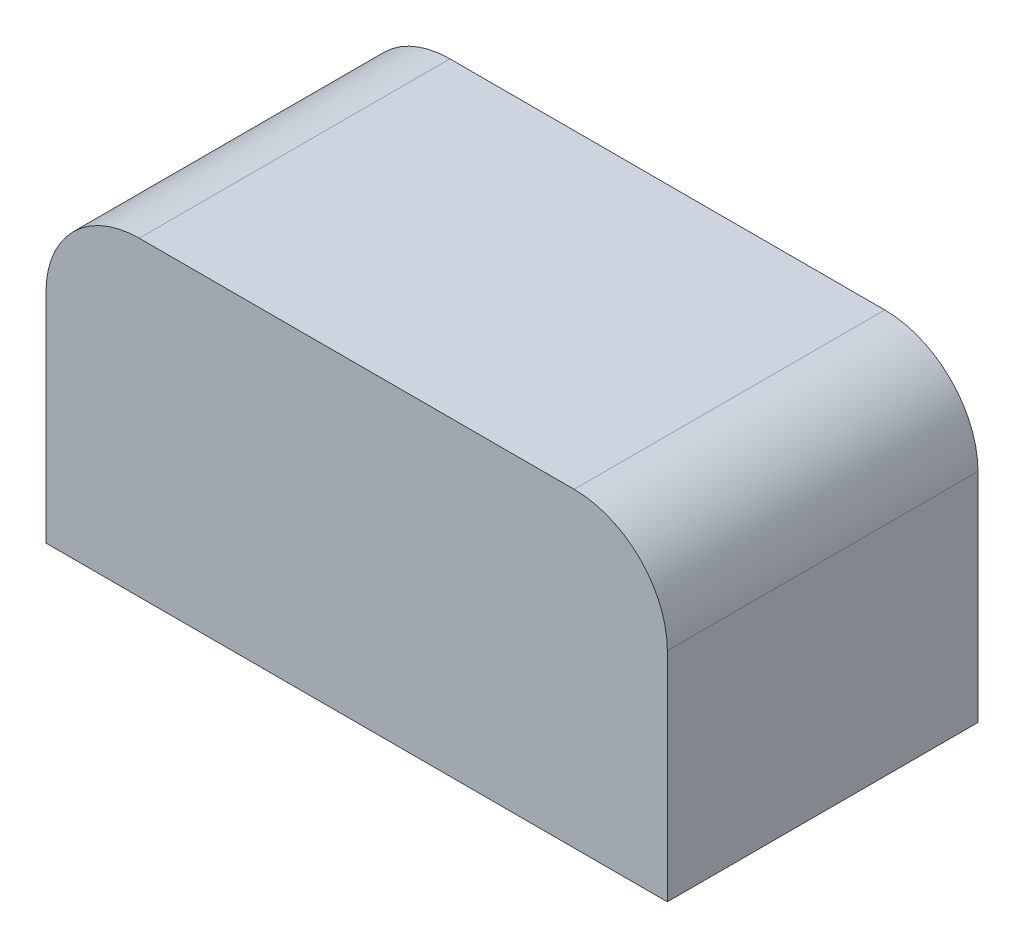
ISO-10303-21;
HEADER;
FILE_DESCRIPTION(('STEP AP214'),'2;1');
FILE_NAME('part.step','',(''),(''),'','','');
FILE_SCHEMA(('AUTOMOTIVE_DESIGN { 1 0 10303 214 1 1 1 1 }'));
ENDSEC;
DATA;
#1=APPLICATION_CONTEXT('core data for automotive mechanical design processes');
#2=APPLICATION_PROTOCOL_DEFINITION('international standard','automotive_design',2000,#1);
#3=PRODUCT_CONTEXT('',#1,'mechanical');
#4=PRODUCT('Part','Part','',(#3));
#5=PRODUCT_RELATED_PRODUCT_CATEGORY('part','',(#4));
#6=PRODUCT_DEFINITION_FORMATION('','',#4);
#7=PRODUCT_DEFINITION_CONTEXT('part definition',#1,'design');
#8=PRODUCT_DEFINITION('design','',#6,#7);
#9=PRODUCT_DEFINITION_SHAPE('','',#8);
#10=(LENGTH_UNIT() NAMED_UNIT(*) SI_UNIT(.MILLI.,.METRE.));
#11=(NAMED_UNIT(*) PLANE_ANGLE_UNIT() SI_UNIT($,.RADIAN.));
#12=(NAMED_UNIT(*) SI_UNIT($,.STERADIAN.) SOLID_ANGLE_UNIT());
#13=UNCERTAINTY_MEASURE_WITH_UNIT(LENGTH_MEASURE(1.E-05),#10,'distance_accuracy_value','');
#14=(GEOMETRIC_REPRESENTATION_CONTEXT(3) GLOBAL_UNCERTAINTY_ASSIGNED_CONTEXT((#13)) GLOBAL_UNIT_ASSIGNED_CONTEXT((#10,
#11,#12)) REPRESENTATION_CONTEXT('',''));
#15=CARTESIAN_POINT('',(0.,0.,0.));
#16=DIRECTION('',(0.,0.,1.));
#17=DIRECTION('',(1.,0.,0.));
#18=AXIS2_PLACEMENT_3D('',#15,#16,#17);
#19=CARTESIAN_POINT('',(-173.021650730834,239.381138350752,10.));
#20=DIRECTION('',(1.,0.,0.));
#21=DIRECTION('',(0.,0.,-1.));
#22=AXIS2_PLACEMENT_3D('',#19,#20,#21);
#23=PLANE('',#22);
#24=DIRECTION('',(0.,-1.,0.));
#25=VECTOR('',#24,1.);
#26=CARTESIAN_POINT('',(-173.021650730834,239.381138350752,10.));
#27=LINE('',#26,#25);
#28=CARTESIAN_POINT('',(-173.021650730834,246.381138350752,10.));
#29=VERTEX_POINT('',#28);
#30=CARTESIAN_POINT('',(-173.021650730834,239.381138350752,10.));
#31=VERTEX_POINT('',#30);
#32=EDGE_CURVE('E85',#29,#31,#27,.T.);
#33=ORIENTED_EDGE('',*,*,#32,.F.);
#34=DIRECTION('',(0.,0.,-1.));
#35=VECTOR('',#34,1.);
#36=CARTESIAN_POINT('',(-173.021650730834,246.381138350752,10.));
#37=LINE('',#36,#35);
#38=CARTESIAN_POINT('',(-173.021650730834,246.381138350752,0.));
#39=VERTEX_POINT('',#38);
#40=EDGE_CURVE('E11',#29,#39,#37,.T.);
#41=ORIENTED_EDGE('',*,*,#40,.T.);
#42=DIRECTION('',(0.,-1.,0.));
#43=VECTOR('',#42,1.);
#44=CARTESIAN_POINT('',(-173.021650730834,239.381138350752,0.));
#45=LINE('',#44,#43);
#46=CARTESIAN_POINT('',(-173.021650730834,239.381138350752,0.));
#47=VERTEX_POINT('',#46);
#48=EDGE_CURVE('E104',#39,#47,#45,.T.);
#49=ORIENTED_EDGE('',*,*,#48,.T.);
#50=DIRECTION('',(0.,0.,-1.));
#51=VECTOR('',#50,1.);
#52=CARTESIAN_POINT('',(-173.021650730834,239.381138350752,10.));
#53=LINE('',#52,#51);
#54=EDGE_CURVE('E98',#31,#47,#53,.T.);
#55=ORIENTED_EDGE('',*,*,#54,.F.);
#56=EDGE_LOOP('',(#33,#41,#49,#55));
#57=FACE_BOUND('',#56,.T.);
#58=ADVANCED_FACE('F32',(#57),#23,.F.);
#59=CARTESIAN_POINT('',(-173.021650730834,239.381138350752,10.));
#60=DIRECTION('',(0.,1.,0.));
#61=DIRECTION('',(0.,0.,1.));
#62=AXIS2_PLACEMENT_3D('',#59,#60,#61);
#63=PLANE('',#62);
#64=DIRECTION('',(1.,0.,0.));
#65=VECTOR('',#64,1.);
#66=CARTESIAN_POINT('',(-173.021650730834,239.381138350752,0.));
#67=LINE('',#66,#65);
#68=CARTESIAN_POINT('',(-153.021650730834,239.381138350752,0.));
#69=VERTEX_POINT('',#68);
#70=EDGE_CURVE('E137',#47,#69,#67,.T.);
#71=ORIENTED_EDGE('',*,*,#70,.T.);
#72=DIRECTION('',(0.,0.,-1.));
#73=VECTOR('',#72,1.);
#74=CARTESIAN_POINT('',(-153.021650730834,239.381138350752,10.));
#75=LINE('',#74,#73);
#76=CARTESIAN_POINT('',(-153.021650730834,239.381138350752,10.));
#77=VERTEX_POINT('',#76);
#78=EDGE_CURVE('E100',#77,#69,#75,.T.);
#79=ORIENTED_EDGE('',*,*,#78,.F.);
#80=DIRECTION('',(1.,0.,0.));
#81=VECTOR('',#80,1.);
#82=CARTESIAN_POINT('',(-173.021650730834,239.381138350752,10.));
#83=LINE('',#82,#81);
#84=EDGE_CURVE('E88',#31,#77,#83,.T.);
#85=ORIENTED_EDGE('',*,*,#84,.F.);
#86=ORIENTED_EDGE('',*,*,#54,.T.);
#87=EDGE_LOOP('',(#71,#79,#85,#86));
#88=FACE_BOUND('',#87,.T.);
#89=ADVANCED_FACE('F97',(#88),#63,.F.);
#90=CARTESIAN_POINT('',(-153.021650730834,239.381138350752,10.));
#91=DIRECTION('',(-1.,0.,0.));
#92=DIRECTION('',(0.,0.,1.));
#93=AXIS2_PLACEMENT_3D('',#90,#91,#92);
#94=PLANE('',#93);
#95=DIRECTION('',(0.,1.,0.));
#96=VECTOR('',#95,1.);
#97=CARTESIAN_POINT('',(-153.021650730834,239.381138350752,0.));
#98=LINE('',#97,#96);
#99=CARTESIAN_POINT('',(-153.021650730834,246.381138350752,0.));
#100=VERTEX_POINT('',#99);
#101=EDGE_CURVE('E135',#69,#100,#98,.T.);
#102=ORIENTED_EDGE('',*,*,#101,.T.);
#103=DIRECTION('',(0.,0.,-1.));
#104=VECTOR('',#103,1.);
#105=CARTESIAN_POINT('',(-153.021650730834,246.381138350752,10.));
#106=LINE('',#105,#104);
#107=CARTESIAN_POINT('',(-153.021650730834,246.381138350752,10.));
#108=VERTEX_POINT('',#107);
#109=EDGE_CURVE('E55',#100,#108,#106,.F.);
#110=ORIENTED_EDGE('',*,*,#109,.T.);
#111=DIRECTION('',(0.,1.,0.));
#112=VECTOR('',#111,1.);
#113=CARTESIAN_POINT('',(-153.021650730834,239.381138350752,10.));
#114=LINE('',#113,#112);
#115=EDGE_CURVE('E101',#77,#108,#114,.T.);
#116=ORIENTED_EDGE('',*,*,#115,.F.);
#117=ORIENTED_EDGE('',*,*,#78,.T.);
#118=EDGE_LOOP('',(#102,#110,#116,#117));
#119=FACE_BOUND('',#118,.T.);
#120=ADVANCED_FACE('F136',(#119),#94,.F.);
#121=CARTESIAN_POINT('',(-173.021650730834,249.381138350752,10.));
#122=DIRECTION('',(0.,-1.,0.));
#123=DIRECTION('',(0.,0.,-1.));
#124=AXIS2_PLACEMENT_3D('',#121,#122,#123);
#125=PLANE('',#124);
#126=DIRECTION('',(-1.,0.,0.));
#127=VECTOR('',#126,1.);
#128=CARTESIAN_POINT('',(-173.021650730834,249.381138350752,10.));
#129=LINE('',#128,#127);
#130=CARTESIAN_POINT('',(-156.021650730834,249.381138350752,10.));
#131=VERTEX_POINT('',#130);
#132=CARTESIAN_POINT('',(-170.021650730834,249.381138350752,10.));
#133=VERTEX_POINT('',#132);
#134=EDGE_CURVE('E110',#131,#133,#129,.T.);
#135=ORIENTED_EDGE('',*,*,#134,.F.);
#136=DIRECTION('',(0.,0.,-1.));
#137=VECTOR('',#136,1.);
#138=CARTESIAN_POINT('',(-156.021650730834,249.381138350752,10.));
#139=LINE('',#138,#137);
#140=CARTESIAN_POINT('',(-156.021650730834,249.381138350752,0.));
#141=VERTEX_POINT('',#140);
#142=EDGE_CURVE('E108',#131,#141,#139,.T.);
#143=ORIENTED_EDGE('',*,*,#142,.T.);
#144=DIRECTION('',(-1.,0.,0.));
#145=VECTOR('',#144,1.);
#146=CARTESIAN_POINT('',(-173.021650730834,249.381138350752,0.));
#147=LINE('',#146,#145);
#148=CARTESIAN_POINT('',(-170.021650730834,249.381138350752,0.));
#149=VERTEX_POINT('',#148);
#150=EDGE_CURVE('E93',#141,#149,#147,.T.);
#151=ORIENTED_EDGE('',*,*,#150,.T.);
#152=DIRECTION('',(0.,0.,-1.));
#153=VECTOR('',#152,1.);
#154=CARTESIAN_POINT('',(-170.021650730834,249.381138350752,10.));
#155=LINE('',#154,#153);
#156=EDGE_CURVE('E106',#149,#133,#155,.F.);
#157=ORIENTED_EDGE('',*,*,#156,.T.);
#158=EDGE_LOOP('',(#135,#143,#151,#157));
#159=FACE_BOUND('',#158,.T.);
#160=ADVANCED_FACE('F126',(#159),#125,.F.);
#161=CARTESIAN_POINT('',(0.,0.,10.));
#162=DIRECTION('',(0.,0.,-1.));
#163=DIRECTION('',(-1.,0.,0.));
#164=AXIS2_PLACEMENT_3D('',#161,#162,#163);
#165=PLANE('',#164);
#166=ORIENTED_EDGE('',*,*,#115,.T.);
#167=CARTESIAN_POINT('',(-156.021650730834,246.381138350752,10.));
#168=DIRECTION('',(0.,0.,-1.));
#169=DIRECTION('',(-1.,0.,0.));
#170=AXIS2_PLACEMENT_3D('',#167,#168,#169);
#171=CIRCLE('',#170,3.);
#172=EDGE_CURVE('E40',#108,#131,#171,.F.);
#173=ORIENTED_EDGE('',*,*,#172,.T.);
#174=ORIENTED_EDGE('',*,*,#134,.T.);
#175=CARTESIAN_POINT('',(-170.021650730834,246.381138350752,10.));
#176=DIRECTION('',(0.,0.,-1.));
#177=DIRECTION('',(-1.,0.,0.));
#178=AXIS2_PLACEMENT_3D('',#175,#176,#177);
#179=CIRCLE('',#178,3.);
#180=EDGE_CURVE('E47',#133,#29,#179,.F.);
#181=ORIENTED_EDGE('',*,*,#180,.T.);
#182=ORIENTED_EDGE('',*,*,#32,.T.);
#183=ORIENTED_EDGE('',*,*,#84,.T.);
#184=EDGE_LOOP('',(#166,#173,#174,#181,#182,#183));
#185=FACE_BOUND('',#184,.T.);
#186=ADVANCED_FACE('F87',(#185),#165,.F.);
#187=CARTESIAN_POINT('',(0.,0.,0.));
#188=DIRECTION('',(0.,0.,-1.));
#189=DIRECTION('',(-1.,0.,0.));
#190=AXIS2_PLACEMENT_3D('',#187,#188,#189);
#191=PLANE('',#190);
#192=ORIENTED_EDGE('',*,*,#150,.F.);
#193=CARTESIAN_POINT('',(-156.021650730834,246.381138350752,0.));
#194=DIRECTION('',(0.,0.,-1.));
#195=DIRECTION('',(-1.,0.,0.));
#196=AXIS2_PLACEMENT_3D('',#193,#194,#195);
#197=CIRCLE('',#196,3.);
#198=EDGE_CURVE('E118',#141,#100,#197,.T.);
#199=ORIENTED_EDGE('',*,*,#198,.T.);
#200=ORIENTED_EDGE('',*,*,#101,.F.);
#201=ORIENTED_EDGE('',*,*,#70,.F.);
#202=ORIENTED_EDGE('',*,*,#48,.F.);
#203=CARTESIAN_POINT('',(-170.021650730834,246.381138350752,0.));
#204=DIRECTION('',(0.,0.,-1.));
#205=DIRECTION('',(-1.,0.,0.));
#206=AXIS2_PLACEMENT_3D('',#203,#204,#205);
#207=CIRCLE('',#206,3.);
#208=EDGE_CURVE('E116',#39,#149,#207,.T.);
#209=ORIENTED_EDGE('',*,*,#208,.T.);
#210=EDGE_LOOP('',(#192,#199,#200,#201,#202,#209));
#211=FACE_BOUND('',#210,.T.);
#212=ADVANCED_FACE('F134',(#211),#191,.T.);
#213=CARTESIAN_POINT('',(-156.021650730834,246.381138350752,10.));
#214=DIRECTION('',(0.,0.,-1.));
#215=DIRECTION('',(-1.,0.,0.));
#216=AXIS2_PLACEMENT_3D('',#213,#214,#215);
#217=CYLINDRICAL_SURFACE('',#216,3.);
#218=ORIENTED_EDGE('',*,*,#172,.F.);
#219=ORIENTED_EDGE('',*,*,#109,.F.);
#220=ORIENTED_EDGE('',*,*,#198,.F.);
#221=ORIENTED_EDGE('',*,*,#142,.F.);
#222=EDGE_LOOP('',(#218,#219,#220,#221));
#223=FACE_BOUND('',#222,.T.);
#224=ADVANCED_FACE('F131',(#223),#217,.T.);
#225=CARTESIAN_POINT('',(-170.021650730834,246.381138350752,10.));
#226=DIRECTION('',(0.,0.,-1.));
#227=DIRECTION('',(-1.,0.,0.));
#228=AXIS2_PLACEMENT_3D('',#225,#226,#227);
#229=CYLINDRICAL_SURFACE('',#228,3.);
#230=ORIENTED_EDGE('',*,*,#180,.F.);
#231=ORIENTED_EDGE('',*,*,#156,.F.);
#232=ORIENTED_EDGE('',*,*,#208,.F.);
#233=ORIENTED_EDGE('',*,*,#40,.F.);
#234=EDGE_LOOP('',(#230,#231,#232,#233));
#235=FACE_BOUND('',#234,.T.);
#236=ADVANCED_FACE('F34',(#235),#229,.T.);
#237=CLOSED_SHELL('',(#58,#89,#120,#160,#186,#212,#224,#236));
#238=MANIFOLD_SOLID_BREP('B2',#237);
#239=ADVANCED_BREP_SHAPE_REPRESENTATION('',(#18,#238),#14);
#240=SHAPE_DEFINITION_REPRESENTATION(#9,#239);
ENDSEC;
END-ISO-10303-21;
